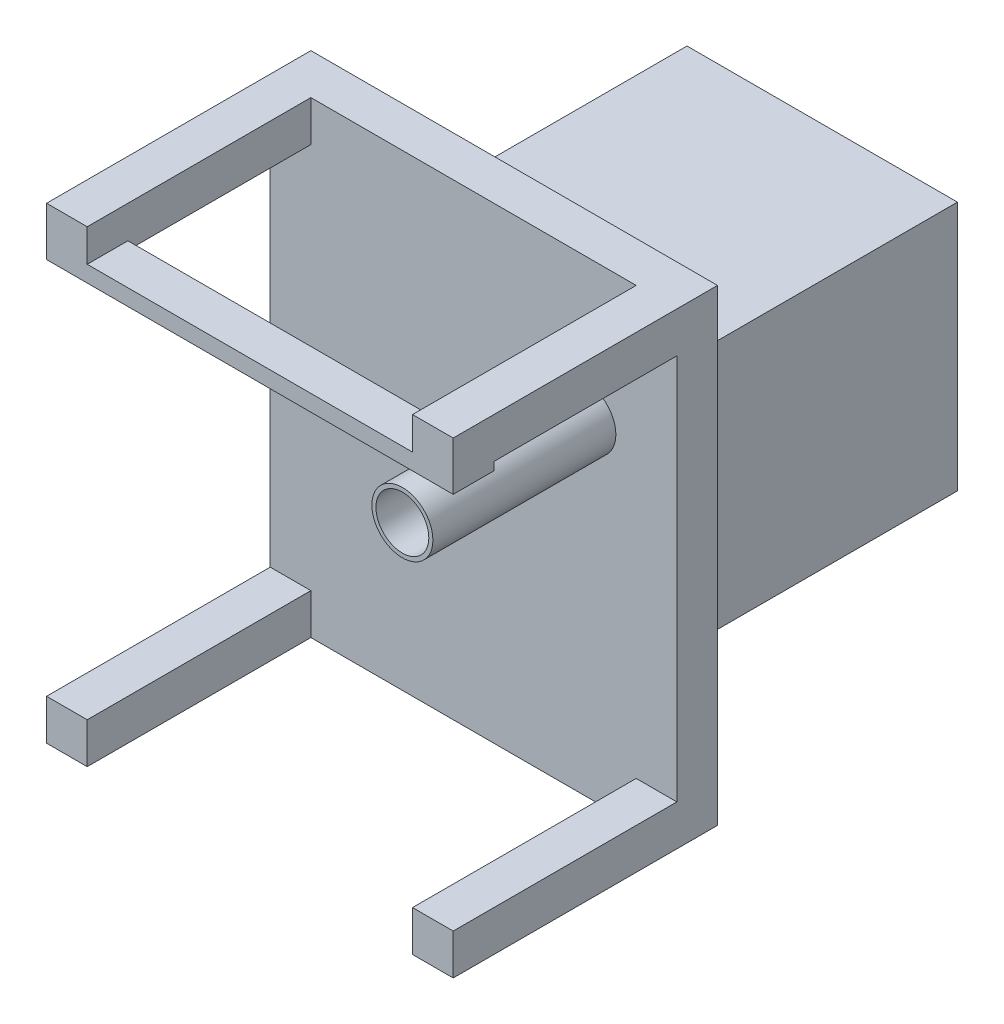
ISO-10303-21;
HEADER;
FILE_DESCRIPTION(('STEP AP214'),'2;1');
FILE_NAME('part.step','',(''),(''),'','','');
FILE_SCHEMA(('AUTOMOTIVE_DESIGN { 1 0 10303 214 1 1 1 1 }'));
ENDSEC;
DATA;
#1=APPLICATION_CONTEXT('core data for automotive mechanical design processes');
#2=APPLICATION_PROTOCOL_DEFINITION('international standard','automotive_design',2000,#1);
#3=PRODUCT_CONTEXT('',#1,'mechanical');
#4=PRODUCT('Part','Part','',(#3));
#5=PRODUCT_RELATED_PRODUCT_CATEGORY('part','',(#4));
#6=PRODUCT_DEFINITION_FORMATION('','',#4);
#7=PRODUCT_DEFINITION_CONTEXT('part definition',#1,'design');
#8=PRODUCT_DEFINITION('design','',#6,#7);
#9=PRODUCT_DEFINITION_SHAPE('','',#8);
#10=(LENGTH_UNIT() NAMED_UNIT(*) SI_UNIT(.MILLI.,.METRE.));
#11=(NAMED_UNIT(*) PLANE_ANGLE_UNIT() SI_UNIT($,.RADIAN.));
#12=(NAMED_UNIT(*) SI_UNIT($,.STERADIAN.) SOLID_ANGLE_UNIT());
#13=UNCERTAINTY_MEASURE_WITH_UNIT(LENGTH_MEASURE(1.E-05),#10,'distance_accuracy_value','');
#14=(GEOMETRIC_REPRESENTATION_CONTEXT(3) GLOBAL_UNCERTAINTY_ASSIGNED_CONTEXT((#13)) GLOBAL_UNIT_ASSIGNED_CONTEXT((#10,
#11,#12)) REPRESENTATION_CONTEXT('',''));
#15=CARTESIAN_POINT('',(0.,0.,0.));
#16=DIRECTION('',(0.,0.,1.));
#17=DIRECTION('',(1.,0.,0.));
#18=AXIS2_PLACEMENT_3D('',#15,#16,#17);
#19=CARTESIAN_POINT('',(0.,0.,0.));
#20=DIRECTION('',(0.,0.,1.));
#21=DIRECTION('',(1.,0.,0.));
#22=AXIS2_PLACEMENT_3D('',#19,#20,#21);
#23=PLANE('',#22);
#24=DIRECTION('',(1.,0.,0.));
#25=VECTOR('',#24,1.);
#26=CARTESIAN_POINT('',(-0.002000000000002,74.7384532343858,0.));
#27=LINE('',#26,#25);
#28=CARTESIAN_POINT('',(71.5,74.7384532343858,0.));
#29=VERTEX_POINT('',#28);
#30=CARTESIAN_POINT('',(75.0000000000001,74.7384532343858,0.));
#31=VERTEX_POINT('',#30);
#32=EDGE_CURVE('E272',#29,#31,#27,.T.);
#33=ORIENTED_EDGE('',*,*,#32,.F.);
#34=DIRECTION('',(0.,1.,0.));
#35=VECTOR('',#34,1.);
#36=CARTESIAN_POINT('',(71.5,-0.002000000000002,0.));
#37=LINE('',#36,#35);
#38=CARTESIAN_POINT('',(71.5,78.2384532343858,0.));
#39=VERTEX_POINT('',#38);
#40=EDGE_CURVE('E257',#29,#39,#37,.T.);
#41=ORIENTED_EDGE('',*,*,#40,.T.);
#42=CARTESIAN_POINT('',(77.5,80.7384532343858,0.));
#43=DIRECTION('',(0.,0.,1.));
#44=DIRECTION('',(1.,0.,0.));
#45=AXIS2_PLACEMENT_3D('',#42,#43,#44);
#46=CIRCLE('',#45,6.5);
#47=EDGE_CURVE('E273',#39,#31,#46,.T.);
#48=ORIENTED_EDGE('',*,*,#47,.T.);
#49=EDGE_LOOP('',(#33,#41,#48));
#50=FACE_BOUND('',#49,.T.);
#51=ADVANCED_FACE('F43',(#50),#23,.F.);
#52=CARTESIAN_POINT('',(80.,74.7384532343858,0.));
#53=VERTEX_POINT('',#52);
#54=CARTESIAN_POINT('',(84.,74.7384532343858,0.));
#55=VERTEX_POINT('',#54);
#56=EDGE_CURVE('E60',#53,#55,#27,.T.);
#57=ORIENTED_EDGE('',*,*,#56,.F.);
#58=CARTESIAN_POINT('',(84.,80.7384532343858,0.));
#59=VERTEX_POINT('',#58);
#60=EDGE_CURVE('E361',#53,#59,#46,.T.);
#61=ORIENTED_EDGE('',*,*,#60,.T.);
#62=DIRECTION('',(0.,1.,0.));
#63=VECTOR('',#62,1.);
#64=CARTESIAN_POINT('',(84.,30.7384532343858,0.));
#65=LINE('',#64,#63);
#66=EDGE_CURVE('E332',#55,#59,#65,.T.);
#67=ORIENTED_EDGE('',*,*,#66,.F.);
#68=EDGE_LOOP('',(#57,#61,#67));
#69=FACE_BOUND('',#68,.T.);
#70=ADVANCED_FACE('F606',(#69),#23,.F.);
#71=CARTESIAN_POINT('',(84.,35.7384532343858,0.));
#72=DIRECTION('',(0.,-1.,0.));
#73=DIRECTION('',(0.,0.,-1.));
#74=AXIS2_PLACEMENT_3D('',#71,#72,#73);
#75=PLANE('',#74);
#76=DIRECTION('',(1.,0.,0.));
#77=VECTOR('',#76,1.);
#78=CARTESIAN_POINT('',(-0.002000000000002,35.7384532343858,-50.));
#79=LINE('',#78,#77);
#80=CARTESIAN_POINT('',(27.5,35.7384532343858,-50.));
#81=VERTEX_POINT('',#80);
#82=CARTESIAN_POINT('',(84.,35.7384532343858,-50.));
#83=VERTEX_POINT('',#82);
#84=EDGE_CURVE('E277',#81,#83,#79,.T.);
#85=ORIENTED_EDGE('',*,*,#84,.T.);
#86=DIRECTION('',(0.,0.,1.));
#87=VECTOR('',#86,1.);
#88=CARTESIAN_POINT('',(84.,35.7384532343858,-70.));
#89=LINE('',#88,#87);
#90=CARTESIAN_POINT('',(84.,35.7384532343858,-70.));
#91=VERTEX_POINT('',#90);
#92=EDGE_CURVE('E339',#91,#83,#89,.T.);
#93=ORIENTED_EDGE('',*,*,#92,.F.);
#94=DIRECTION('',(-1.,0.,0.));
#95=VECTOR('',#94,1.);
#96=CARTESIAN_POINT('',(84.,35.7384532343858,-70.));
#97=LINE('',#96,#95);
#98=CARTESIAN_POINT('',(27.5,35.7384532343858,-70.));
#99=VERTEX_POINT('',#98);
#100=EDGE_CURVE('E297',#91,#99,#97,.T.);
#101=ORIENTED_EDGE('',*,*,#100,.T.);
#102=DIRECTION('',(0.,0.,-1.));
#103=VECTOR('',#102,1.);
#104=CARTESIAN_POINT('',(27.5,35.7384532343858,0.));
#105=LINE('',#104,#103);
#106=EDGE_CURVE('E300',#81,#99,#105,.T.);
#107=ORIENTED_EDGE('',*,*,#106,.F.);
#108=EDGE_LOOP('',(#85,#93,#101,#107));
#109=FACE_BOUND('',#108,.T.);
#110=ADVANCED_FACE('F611',(#109),#75,.F.);
#111=CARTESIAN_POINT('',(84.,30.7384532343858,-70.));
#112=DIRECTION('',(1.,0.,0.));
#113=DIRECTION('',(0.,0.,-1.));
#114=AXIS2_PLACEMENT_3D('',#111,#112,#113);
#115=PLANE('',#114);
#116=DIRECTION('',(0.,-0.615031798693877,-0.788502306017791));
#117=VECTOR('',#116,1.);
#118=CARTESIAN_POINT('',(84.,35.7384532343858,-50.));
#119=LINE('',#118,#117);
#120=EDGE_CURVE('E288',#55,#83,#119,.T.);
#121=ORIENTED_EDGE('',*,*,#120,.F.);
#122=ORIENTED_EDGE('',*,*,#66,.T.);
#123=CARTESIAN_POINT('',(84.,87.2384532343858,0.));
#124=VERTEX_POINT('',#123);
#125=EDGE_CURVE('E321',#59,#124,#65,.T.);
#126=ORIENTED_EDGE('',*,*,#125,.T.);
#127=DIRECTION('',(0.,0.,1.));
#128=VECTOR('',#127,1.);
#129=CARTESIAN_POINT('',(84.,87.2384532343858,-70.));
#130=LINE('',#129,#128);
#131=CARTESIAN_POINT('',(84.,87.2384532343858,-70.));
#132=VERTEX_POINT('',#131);
#133=EDGE_CURVE('E337',#132,#124,#130,.T.);
#134=ORIENTED_EDGE('',*,*,#133,.F.);
#135=DIRECTION('',(0.,1.,0.));
#136=VECTOR('',#135,1.);
#137=CARTESIAN_POINT('',(84.,30.7384532343858,-70.));
#138=LINE('',#137,#136);
#139=EDGE_CURVE('E322',#91,#132,#138,.T.);
#140=ORIENTED_EDGE('',*,*,#139,.F.);
#141=ORIENTED_EDGE('',*,*,#92,.T.);
#142=EDGE_LOOP('',(#121,#122,#126,#134,#140,#141));
#143=FACE_BOUND('',#142,.T.);
#144=ADVANCED_FACE('F645',(#143),#115,.F.);
#145=CARTESIAN_POINT('',(27.5,-0.002000000000002,-50.));
#146=DIRECTION('',(-0.750713516922755,0.,0.660627894892025));
#147=DIRECTION('',(0.660627894892025,0.,0.750713516922755));
#148=AXIS2_PLACEMENT_3D('',#145,#146,#147);
#149=PLANE('',#148);
#150=DIRECTION('',(-0.570084031750296,-0.505301755415035,-0.647822763352609));
#151=VECTOR('',#150,1.);
#152=CARTESIAN_POINT('',(18.561965418835,27.8161044010804,-60.1568574785966));
#153=LINE('',#152,#151);
#154=EDGE_CURVE('E262',#29,#81,#153,.T.);
#155=ORIENTED_EDGE('',*,*,#154,.T.);
#156=DIRECTION('',(0.,1.,0.));
#157=VECTOR('',#156,1.);
#158=CARTESIAN_POINT('',(27.5,-0.002000000000002,-50.));
#159=LINE('',#158,#157);
#160=CARTESIAN_POINT('',(27.5,87.2384532343858,-50.));
#161=VERTEX_POINT('',#160);
#162=EDGE_CURVE('E268',#81,#161,#159,.T.);
#163=ORIENTED_EDGE('',*,*,#162,.T.);
#164=DIRECTION('',(0.660627894892025,0.,0.750713516922755));
#165=VECTOR('',#164,1.);
#166=CARTESIAN_POINT('',(27.5,87.2384532343858,-50.));
#167=LINE('',#166,#165);
#168=CARTESIAN_POINT('',(71.5,87.2384532343858,0.));
#169=VERTEX_POINT('',#168);
#170=EDGE_CURVE('E287',#161,#169,#167,.T.);
#171=ORIENTED_EDGE('',*,*,#170,.T.);
#172=CARTESIAN_POINT('',(71.5,83.2384532343858,0.));
#173=VERTEX_POINT('',#172);
#174=EDGE_CURVE('E270',#173,#169,#37,.T.);
#175=ORIENTED_EDGE('',*,*,#174,.F.);
#176=EDGE_CURVE('E266',#39,#173,#37,.T.);
#177=ORIENTED_EDGE('',*,*,#176,.F.);
#178=ORIENTED_EDGE('',*,*,#40,.F.);
#179=EDGE_LOOP('',(#155,#163,#171,#175,#177,#178));
#180=FACE_BOUND('',#179,.T.);
#181=ADVANCED_FACE('F259',(#180),#149,.F.);
#182=ORIENTED_EDGE('',*,*,#174,.T.);
#183=DIRECTION('',(-1.,0.,0.));
#184=VECTOR('',#183,1.);
#185=CARTESIAN_POINT('',(22.5,87.2384532343858,0.));
#186=LINE('',#185,#184);
#187=CARTESIAN_POINT('',(77.5,87.2384532343858,0.));
#188=VERTEX_POINT('',#187);
#189=EDGE_CURVE('E313',#188,#169,#186,.T.);
#190=ORIENTED_EDGE('',*,*,#189,.F.);
#191=EDGE_CURVE('E366',#188,#173,#46,.T.);
#192=ORIENTED_EDGE('',*,*,#191,.T.);
#193=EDGE_LOOP('',(#182,#190,#192));
#194=FACE_BOUND('',#193,.T.);
#195=ADVANCED_FACE('F612',(#194),#23,.F.);
#196=CARTESIAN_POINT('',(22.5,87.2384532343858,-70.));
#197=DIRECTION('',(0.,1.,0.));
#198=DIRECTION('',(0.,0.,1.));
#199=AXIS2_PLACEMENT_3D('',#196,#197,#198);
#200=PLANE('',#199);
#201=ORIENTED_EDGE('',*,*,#170,.F.);
#202=DIRECTION('',(0.,0.,1.));
#203=VECTOR('',#202,1.);
#204=CARTESIAN_POINT('',(27.5,87.2384532343858,-70.));
#205=LINE('',#204,#203);
#206=CARTESIAN_POINT('',(27.5,87.2384532343858,-70.));
#207=VERTEX_POINT('',#206);
#208=EDGE_CURVE('E355',#207,#161,#205,.T.);
#209=ORIENTED_EDGE('',*,*,#208,.F.);
#210=DIRECTION('',(-1.,0.,0.));
#211=VECTOR('',#210,1.);
#212=CARTESIAN_POINT('',(22.5,87.2384532343858,-70.));
#213=LINE('',#212,#211);
#214=EDGE_CURVE('E306',#132,#207,#213,.T.);
#215=ORIENTED_EDGE('',*,*,#214,.F.);
#216=ORIENTED_EDGE('',*,*,#133,.T.);
#217=EDGE_CURVE('E307',#124,#188,#186,.T.);
#218=ORIENTED_EDGE('',*,*,#217,.T.);
#219=ORIENTED_EDGE('',*,*,#189,.T.);
#220=EDGE_LOOP('',(#201,#209,#215,#216,#218,#219));
#221=FACE_BOUND('',#220,.T.);
#222=ADVANCED_FACE('F623',(#221),#200,.F.);
#223=CARTESIAN_POINT('',(27.5,35.7384532343858,0.));
#224=DIRECTION('',(-1.,0.,0.));
#225=DIRECTION('',(0.,0.,1.));
#226=AXIS2_PLACEMENT_3D('',#223,#224,#225);
#227=PLANE('',#226);
#228=ORIENTED_EDGE('',*,*,#162,.F.);
#229=ORIENTED_EDGE('',*,*,#106,.T.);
#230=DIRECTION('',(0.,1.,0.));
#231=VECTOR('',#230,1.);
#232=CARTESIAN_POINT('',(27.5,35.7384532343858,-70.));
#233=LINE('',#232,#231);
#234=EDGE_CURVE('E295',#99,#207,#233,.T.);
#235=ORIENTED_EDGE('',*,*,#234,.T.);
#236=ORIENTED_EDGE('',*,*,#208,.T.);
#237=EDGE_LOOP('',(#228,#229,#235,#236));
#238=FACE_BOUND('',#237,.T.);
#239=ADVANCED_FACE('F617',(#238),#227,.F.);
#240=DIRECTION('',(1.,0.,0.));
#241=VECTOR('',#240,1.);
#242=CARTESIAN_POINT('',(0.,115.,0.));
#243=LINE('',#242,#241);
#244=CARTESIAN_POINT('',(0.,115.,0.));
#245=VERTEX_POINT('',#244);
#246=CARTESIAN_POINT('',(100.,115.,0.));
#247=VERTEX_POINT('',#246);
#248=EDGE_CURVE('E493',#245,#247,#243,.T.);
#249=ORIENTED_EDGE('',*,*,#248,.T.);
#250=DIRECTION('',(0.,1.,0.));
#251=VECTOR('',#250,1.);
#252=CARTESIAN_POINT('',(100.,0.,0.));
#253=LINE('',#252,#251);
#254=CARTESIAN_POINT('',(100.,0.,0.));
#255=VERTEX_POINT('',#254);
#256=EDGE_CURVE('E508',#255,#247,#253,.T.);
#257=ORIENTED_EDGE('',*,*,#256,.F.);
#258=DIRECTION('',(1.,0.,0.));
#259=VECTOR('',#258,1.);
#260=CARTESIAN_POINT('',(0.,0.,0.));
#261=LINE('',#260,#259);
#262=CARTESIAN_POINT('',(0.,0.,0.));
#263=VERTEX_POINT('',#262);
#264=EDGE_CURVE('E511',#263,#255,#261,.T.);
#265=ORIENTED_EDGE('',*,*,#264,.F.);
#266=DIRECTION('',(0.,1.,0.));
#267=VECTOR('',#266,1.);
#268=CARTESIAN_POINT('',(0.,0.,0.));
#269=LINE('',#268,#267);
#270=EDGE_CURVE('E498',#263,#245,#269,.T.);
#271=ORIENTED_EDGE('',*,*,#270,.T.);
#272=EDGE_LOOP('',(#249,#257,#265,#271));
#273=FACE_BOUND('',#272,.T.);
#274=DIRECTION('',(1.,0.,0.));
#275=VECTOR('',#274,1.);
#276=CARTESIAN_POINT('',(22.5,92.2384532343858,0.));
#277=LINE('',#276,#275);
#278=CARTESIAN_POINT('',(22.5,92.2384532343858,0.));
#279=VERTEX_POINT('',#278);
#280=CARTESIAN_POINT('',(89.,92.2384532343858,0.));
#281=VERTEX_POINT('',#280);
#282=EDGE_CURVE('E302',#279,#281,#277,.T.);
#283=ORIENTED_EDGE('',*,*,#282,.F.);
#284=DIRECTION('',(0.,-1.,0.));
#285=VECTOR('',#284,1.);
#286=CARTESIAN_POINT('',(22.5,0.,0.));
#287=LINE('',#286,#285);
#288=CARTESIAN_POINT('',(22.5,30.7384532343858,0.));
#289=VERTEX_POINT('',#288);
#290=EDGE_CURVE('E342',#279,#289,#287,.T.);
#291=ORIENTED_EDGE('',*,*,#290,.T.);
#292=DIRECTION('',(-1.,0.,0.));
#293=VECTOR('',#292,1.);
#294=CARTESIAN_POINT('',(0.,30.7384532343858,0.));
#295=LINE('',#294,#293);
#296=CARTESIAN_POINT('',(89.,30.7384532343858,0.));
#297=VERTEX_POINT('',#296);
#298=EDGE_CURVE('E347',#297,#289,#295,.T.);
#299=ORIENTED_EDGE('',*,*,#298,.F.);
#300=DIRECTION('',(0.,-1.,0.));
#301=VECTOR('',#300,1.);
#302=CARTESIAN_POINT('',(89.,30.7384532343858,0.));
#303=LINE('',#302,#301);
#304=EDGE_CURVE('E326',#281,#297,#303,.T.);
#305=ORIENTED_EDGE('',*,*,#304,.F.);
#306=EDGE_LOOP('',(#283,#291,#299,#305));
#307=FACE_BOUND('',#306,.T.);
#308=ADVANCED_FACE('F527',(#273,#307),#23,.F.);
#309=ORIENTED_EDGE('',*,*,#217,.F.);
#310=ORIENTED_EDGE('',*,*,#125,.F.);
#311=EDGE_CURVE('E362',#59,#188,#46,.T.);
#312=ORIENTED_EDGE('',*,*,#311,.T.);
#313=EDGE_LOOP('',(#309,#310,#312));
#314=FACE_BOUND('',#313,.T.);
#315=ADVANCED_FACE('F616',(#314),#23,.F.);
#316=CARTESIAN_POINT('',(10.,115.,65.));
#317=DIRECTION('',(1.,0.,0.));
#318=DIRECTION('',(0.,1.,0.));
#319=AXIS2_PLACEMENT_3D('',#316,#317,#318);
#320=PLANE('',#319);
#321=DIRECTION('',(0.,0.,1.));
#322=VECTOR('',#321,1.);
#323=CARTESIAN_POINT('',(10.,107.,55.));
#324=LINE('',#323,#322);
#325=CARTESIAN_POINT('',(10.,107.,55.));
#326=VERTEX_POINT('',#325);
#327=CARTESIAN_POINT('',(10.,107.,65.));
#328=VERTEX_POINT('',#327);
#329=EDGE_CURVE('E370',#326,#328,#324,.T.);
#330=ORIENTED_EDGE('',*,*,#329,.F.);
#331=DIRECTION('',(0.,-1.,0.));
#332=VECTOR('',#331,1.);
#333=CARTESIAN_POINT('',(10.,107.,55.));
#334=LINE('',#333,#332);
#335=CARTESIAN_POINT('',(10.,105.,55.));
#336=VERTEX_POINT('',#335);
#337=EDGE_CURVE('E381',#326,#336,#334,.T.);
#338=ORIENTED_EDGE('',*,*,#337,.T.);
#339=DIRECTION('',(0.,0.,-1.));
#340=VECTOR('',#339,1.);
#341=CARTESIAN_POINT('',(10.,105.,65.));
#342=LINE('',#341,#340);
#343=CARTESIAN_POINT('',(10.,105.,9.99999999999999));
#344=VERTEX_POINT('',#343);
#345=EDGE_CURVE('E491',#336,#344,#342,.T.);
#346=ORIENTED_EDGE('',*,*,#345,.T.);
#347=DIRECTION('',(0.,-1.,0.));
#348=VECTOR('',#347,1.);
#349=CARTESIAN_POINT('',(10.,115.,9.99999999999999));
#350=LINE('',#349,#348);
#351=CARTESIAN_POINT('',(10.,115.,9.99999999999999));
#352=VERTEX_POINT('',#351);
#353=EDGE_CURVE('E478',#352,#344,#350,.T.);
#354=ORIENTED_EDGE('',*,*,#353,.F.);
#355=DIRECTION('',(0.,0.,-1.));
#356=VECTOR('',#355,1.);
#357=CARTESIAN_POINT('',(10.,115.,65.));
#358=LINE('',#357,#356);
#359=CARTESIAN_POINT('',(10.,115.,65.));
#360=VERTEX_POINT('',#359);
#361=EDGE_CURVE('E489',#360,#352,#358,.T.);
#362=ORIENTED_EDGE('',*,*,#361,.F.);
#363=DIRECTION('',(0.,-1.,0.));
#364=VECTOR('',#363,1.);
#365=CARTESIAN_POINT('',(10.,115.,65.));
#366=LINE('',#365,#364);
#367=EDGE_CURVE('E474',#360,#328,#366,.T.);
#368=ORIENTED_EDGE('',*,*,#367,.T.);
#369=EDGE_LOOP('',(#330,#338,#346,#354,#362,#368));
#370=FACE_BOUND('',#369,.T.);
#371=ADVANCED_FACE('F544',(#370),#320,.T.);
#372=CARTESIAN_POINT('',(90.,115.,65.));
#373=DIRECTION('',(1.,0.,0.));
#374=DIRECTION('',(0.,0.,-1.));
#375=AXIS2_PLACEMENT_3D('',#372,#373,#374);
#376=PLANE('',#375);
#377=DIRECTION('',(0.,-1.,0.));
#378=VECTOR('',#377,1.);
#379=CARTESIAN_POINT('',(90.,107.,55.));
#380=LINE('',#379,#378);
#381=CARTESIAN_POINT('',(90.,107.,55.));
#382=VERTEX_POINT('',#381);
#383=CARTESIAN_POINT('',(90.,105.,55.));
#384=VERTEX_POINT('',#383);
#385=EDGE_CURVE('E383',#382,#384,#380,.T.);
#386=ORIENTED_EDGE('',*,*,#385,.F.);
#387=DIRECTION('',(0.,0.,-1.));
#388=VECTOR('',#387,1.);
#389=CARTESIAN_POINT('',(90.,107.,55.));
#390=LINE('',#389,#388);
#391=CARTESIAN_POINT('',(90.,107.,65.));
#392=VERTEX_POINT('',#391);
#393=EDGE_CURVE('E377',#392,#382,#390,.T.);
#394=ORIENTED_EDGE('',*,*,#393,.F.);
#395=DIRECTION('',(0.,-1.,0.));
#396=VECTOR('',#395,1.);
#397=CARTESIAN_POINT('',(90.,115.,65.));
#398=LINE('',#397,#396);
#399=CARTESIAN_POINT('',(90.,115.,65.));
#400=VERTEX_POINT('',#399);
#401=EDGE_CURVE('E460',#400,#392,#398,.T.);
#402=ORIENTED_EDGE('',*,*,#401,.F.);
#403=DIRECTION('',(0.,0.,-1.));
#404=VECTOR('',#403,1.);
#405=CARTESIAN_POINT('',(90.,115.,65.));
#406=LINE('',#405,#404);
#407=CARTESIAN_POINT('',(90.,115.,9.99999999999999));
#408=VERTEX_POINT('',#407);
#409=EDGE_CURVE('E471',#400,#408,#406,.T.);
#410=ORIENTED_EDGE('',*,*,#409,.T.);
#411=DIRECTION('',(0.,-1.,0.));
#412=VECTOR('',#411,1.);
#413=CARTESIAN_POINT('',(90.,115.,9.99999999999999));
#414=LINE('',#413,#412);
#415=CARTESIAN_POINT('',(90.,105.,9.99999999999999));
#416=VERTEX_POINT('',#415);
#417=EDGE_CURVE('E453',#408,#416,#414,.T.);
#418=ORIENTED_EDGE('',*,*,#417,.T.);
#419=DIRECTION('',(0.,0.,-1.));
#420=VECTOR('',#419,1.);
#421=CARTESIAN_POINT('',(90.,105.,65.));
#422=LINE('',#421,#420);
#423=EDGE_CURVE('E469',#384,#416,#422,.T.);
#424=ORIENTED_EDGE('',*,*,#423,.F.);
#425=EDGE_LOOP('',(#386,#394,#402,#410,#418,#424));
#426=FACE_BOUND('',#425,.T.);
#427=ADVANCED_FACE('F556',(#426),#376,.F.);
#428=CARTESIAN_POINT('',(0.,105.,65.));
#429=DIRECTION('',(0.,1.,0.));
#430=DIRECTION('',(0.,0.,1.));
#431=AXIS2_PLACEMENT_3D('',#428,#429,#430);
#432=PLANE('',#431);
#433=DIRECTION('',(1.,0.,0.));
#434=VECTOR('',#433,1.);
#435=CARTESIAN_POINT('',(100.,105.,55.));
#436=LINE('',#435,#434);
#437=CARTESIAN_POINT('',(0.,105.,55.));
#438=VERTEX_POINT('',#437);
#439=EDGE_CURVE('E390',#438,#336,#436,.T.);
#440=ORIENTED_EDGE('',*,*,#439,.F.);
#441=DIRECTION('',(0.,0.,-1.));
#442=VECTOR('',#441,1.);
#443=CARTESIAN_POINT('',(0.,105.,65.));
#444=LINE('',#443,#442);
#445=CARTESIAN_POINT('',(0.,105.,9.99999999999999));
#446=VERTEX_POINT('',#445);
#447=EDGE_CURVE('E483',#438,#446,#444,.T.);
#448=ORIENTED_EDGE('',*,*,#447,.T.);
#449=DIRECTION('',(1.,0.,0.));
#450=VECTOR('',#449,1.);
#451=CARTESIAN_POINT('',(0.,105.,9.99999999999999));
#452=LINE('',#451,#450);
#453=EDGE_CURVE('E473',#446,#344,#452,.T.);
#454=ORIENTED_EDGE('',*,*,#453,.T.);
#455=ORIENTED_EDGE('',*,*,#345,.F.);
#456=EDGE_LOOP('',(#440,#448,#454,#455));
#457=FACE_BOUND('',#456,.T.);
#458=ADVANCED_FACE('F944',(#457),#432,.F.);
#459=CARTESIAN_POINT('',(100.,105.,65.));
#460=DIRECTION('',(0.,1.,0.));
#461=DIRECTION('',(0.,0.,1.));
#462=AXIS2_PLACEMENT_3D('',#459,#460,#461);
#463=PLANE('',#462);
#464=CARTESIAN_POINT('',(100.,105.,55.));
#465=VERTEX_POINT('',#464);
#466=EDGE_CURVE('E385',#384,#465,#436,.T.);
#467=ORIENTED_EDGE('',*,*,#466,.F.);
#468=ORIENTED_EDGE('',*,*,#423,.T.);
#469=DIRECTION('',(1.,0.,0.));
#470=VECTOR('',#469,1.);
#471=CARTESIAN_POINT('',(100.,105.,9.99999999999999));
#472=LINE('',#471,#470);
#473=CARTESIAN_POINT('',(100.,105.,9.99999999999999));
#474=VERTEX_POINT('',#473);
#475=EDGE_CURVE('E458',#416,#474,#472,.T.);
#476=ORIENTED_EDGE('',*,*,#475,.T.);
#477=DIRECTION('',(0.,0.,-1.));
#478=VECTOR('',#477,1.);
#479=CARTESIAN_POINT('',(100.,105.,65.));
#480=LINE('',#479,#478);
#481=EDGE_CURVE('E463',#465,#474,#480,.T.);
#482=ORIENTED_EDGE('',*,*,#481,.F.);
#483=EDGE_LOOP('',(#467,#468,#476,#482));
#484=FACE_BOUND('',#483,.T.);
#485=ADVANCED_FACE('F570',(#484),#463,.F.);
#486=CARTESIAN_POINT('',(0.,0.,9.99999999999999));
#487=DIRECTION('',(0.,0.,1.));
#488=DIRECTION('',(1.,0.,0.));
#489=AXIS2_PLACEMENT_3D('',#486,#487,#488);
#490=PLANE('',#489);
#491=CARTESIAN_POINT('',(77.5,80.7384532343858,9.99999999999999));
#492=DIRECTION('',(0.,0.,1.));
#493=DIRECTION('',(1.,0.,0.));
#494=AXIS2_PLACEMENT_3D('',#491,#492,#493);
#495=CIRCLE('',#494,7.5);
#496=CARTESIAN_POINT('',(85.,80.7384532343858,9.99999999999999));
#497=VERTEX_POINT('',#496);
#498=EDGE_CURVE('E365',#497,#497,#495,.T.);
#499=ORIENTED_EDGE('',*,*,#498,.F.);
#500=EDGE_LOOP('',(#499));
#501=FACE_BOUND('',#500,.T.);
#502=DIRECTION('',(0.,-1.,0.));
#503=VECTOR('',#502,1.);
#504=CARTESIAN_POINT('',(90.,0.,9.99999999999999));
#505=LINE('',#504,#503);
#506=CARTESIAN_POINT('',(90.,10.,9.99999999999999));
#507=VERTEX_POINT('',#506);
#508=CARTESIAN_POINT('',(90.,0.,9.99999999999999));
#509=VERTEX_POINT('',#508);
#510=EDGE_CURVE('E409',#507,#509,#505,.T.);
#511=ORIENTED_EDGE('',*,*,#510,.F.);
#512=DIRECTION('',(-1.,0.,0.));
#513=VECTOR('',#512,1.);
#514=CARTESIAN_POINT('',(100.,10.,9.99999999999999));
#515=LINE('',#514,#513);
#516=CARTESIAN_POINT('',(100.,10.,9.99999999999999));
#517=VERTEX_POINT('',#516);
#518=EDGE_CURVE('E404',#517,#507,#515,.T.);
#519=ORIENTED_EDGE('',*,*,#518,.F.);
#520=DIRECTION('',(0.,1.,0.));
#521=VECTOR('',#520,1.);
#522=CARTESIAN_POINT('',(100.,0.,9.99999999999999));
#523=LINE('',#522,#521);
#524=EDGE_CURVE('E497',#517,#474,#523,.T.);
#525=ORIENTED_EDGE('',*,*,#524,.T.);
#526=ORIENTED_EDGE('',*,*,#475,.F.);
#527=ORIENTED_EDGE('',*,*,#417,.F.);
#528=DIRECTION('',(1.,0.,0.));
#529=VECTOR('',#528,1.);
#530=CARTESIAN_POINT('',(0.,115.,9.99999999999999));
#531=LINE('',#530,#529);
#532=EDGE_CURVE('E494',#352,#408,#531,.T.);
#533=ORIENTED_EDGE('',*,*,#532,.F.);
#534=ORIENTED_EDGE('',*,*,#353,.T.);
#535=ORIENTED_EDGE('',*,*,#453,.F.);
#536=DIRECTION('',(0.,1.,0.));
#537=VECTOR('',#536,1.);
#538=CARTESIAN_POINT('',(0.,0.,9.99999999999999));
#539=LINE('',#538,#537);
#540=CARTESIAN_POINT('',(0.,10.,9.99999999999999));
#541=VERTEX_POINT('',#540);
#542=EDGE_CURVE('E503',#541,#446,#539,.T.);
#543=ORIENTED_EDGE('',*,*,#542,.F.);
#544=DIRECTION('',(-1.,0.,0.));
#545=VECTOR('',#544,1.);
#546=CARTESIAN_POINT('',(0.,10.,9.99999999999999));
#547=LINE('',#546,#545);
#548=CARTESIAN_POINT('',(10.,10.,9.99999999999999));
#549=VERTEX_POINT('',#548);
#550=EDGE_CURVE('E434',#549,#541,#547,.T.);
#551=ORIENTED_EDGE('',*,*,#550,.F.);
#552=DIRECTION('',(0.,1.,0.));
#553=VECTOR('',#552,1.);
#554=CARTESIAN_POINT('',(10.,0.,9.99999999999999));
#555=LINE('',#554,#553);
#556=CARTESIAN_POINT('',(10.,0.,9.99999999999999));
#557=VERTEX_POINT('',#556);
#558=EDGE_CURVE('E429',#557,#549,#555,.T.);
#559=ORIENTED_EDGE('',*,*,#558,.F.);
#560=DIRECTION('',(1.,0.,0.));
#561=VECTOR('',#560,1.);
#562=CARTESIAN_POINT('',(0.,0.,9.99999999999999));
#563=LINE('',#562,#561);
#564=EDGE_CURVE('E501',#557,#509,#563,.T.);
#565=ORIENTED_EDGE('',*,*,#564,.T.);
#566=EDGE_LOOP('',(#511,#519,#525,#526,#527,#533,#534,#535,#543,#551,#559,#565));
#567=FACE_BOUND('',#566,.T.);
#568=ADVANCED_FACE('F550',(#501,#567),#490,.T.);
#569=CARTESIAN_POINT('',(0.,115.,9.99999999999999));
#570=DIRECTION('',(0.,1.,0.));
#571=DIRECTION('',(0.,0.,1.));
#572=AXIS2_PLACEMENT_3D('',#569,#570,#571);
#573=PLANE('',#572);
#574=ORIENTED_EDGE('',*,*,#248,.F.);
#575=DIRECTION('',(0.,0.,-1.));
#576=VECTOR('',#575,1.);
#577=CARTESIAN_POINT('',(0.,115.,9.99999999999999));
#578=LINE('',#577,#576);
#579=CARTESIAN_POINT('',(0.,115.,65.));
#580=VERTEX_POINT('',#579);
#581=EDGE_CURVE('E11',#580,#245,#578,.T.);
#582=ORIENTED_EDGE('',*,*,#581,.F.);
#583=DIRECTION('',(1.,0.,0.));
#584=VECTOR('',#583,1.);
#585=CARTESIAN_POINT('',(0.,115.,65.));
#586=LINE('',#585,#584);
#587=EDGE_CURVE('E477',#580,#360,#586,.T.);
#588=ORIENTED_EDGE('',*,*,#587,.T.);
#589=ORIENTED_EDGE('',*,*,#361,.T.);
#590=ORIENTED_EDGE('',*,*,#532,.T.);
#591=ORIENTED_EDGE('',*,*,#409,.F.);
#592=DIRECTION('',(-1.,0.,0.));
#593=VECTOR('',#592,1.);
#594=CARTESIAN_POINT('',(100.,115.,65.));
#595=LINE('',#594,#593);
#596=CARTESIAN_POINT('',(100.,115.,65.));
#597=VERTEX_POINT('',#596);
#598=EDGE_CURVE('E457',#597,#400,#595,.T.);
#599=ORIENTED_EDGE('',*,*,#598,.F.);
#600=DIRECTION('',(0.,0.,-1.));
#601=VECTOR('',#600,1.);
#602=CARTESIAN_POINT('',(100.,115.,9.99999999999999));
#603=LINE('',#602,#601);
#604=EDGE_CURVE('E47',#597,#247,#603,.T.);
#605=ORIENTED_EDGE('',*,*,#604,.T.);
#606=EDGE_LOOP('',(#574,#582,#588,#589,#590,#591,#599,#605));
#607=FACE_BOUND('',#606,.T.);
#608=ADVANCED_FACE('F45',(#607),#573,.T.);
#609=CARTESIAN_POINT('',(0.,0.,9.99999999999999));
#610=DIRECTION('',(-1.,0.,0.));
#611=DIRECTION('',(0.,0.,1.));
#612=AXIS2_PLACEMENT_3D('',#609,#610,#611);
#613=PLANE('',#612);
#614=ORIENTED_EDGE('',*,*,#270,.F.);
#615=DIRECTION('',(0.,0.,-1.));
#616=VECTOR('',#615,1.);
#617=CARTESIAN_POINT('',(0.,0.,9.99999999999999));
#618=LINE('',#617,#616);
#619=CARTESIAN_POINT('',(0.,0.,65.));
#620=VERTEX_POINT('',#619);
#621=EDGE_CURVE('E52',#620,#263,#618,.T.);
#622=ORIENTED_EDGE('',*,*,#621,.F.);
#623=DIRECTION('',(0.,-1.,0.));
#624=VECTOR('',#623,1.);
#625=CARTESIAN_POINT('',(0.,0.,65.));
#626=LINE('',#625,#624);
#627=CARTESIAN_POINT('',(0.,10.,65.));
#628=VERTEX_POINT('',#627);
#629=EDGE_CURVE('E430',#628,#620,#626,.T.);
#630=ORIENTED_EDGE('',*,*,#629,.F.);
#631=DIRECTION('',(0.,0.,-1.));
#632=VECTOR('',#631,1.);
#633=CARTESIAN_POINT('',(0.,10.,65.));
#634=LINE('',#633,#632);
#635=EDGE_CURVE('E440',#628,#541,#634,.T.);
#636=ORIENTED_EDGE('',*,*,#635,.T.);
#637=ORIENTED_EDGE('',*,*,#542,.T.);
#638=ORIENTED_EDGE('',*,*,#447,.F.);
#639=DIRECTION('',(0.,1.,0.));
#640=VECTOR('',#639,1.);
#641=CARTESIAN_POINT('',(0.,103.,55.));
#642=LINE('',#641,#640);
#643=CARTESIAN_POINT('',(0.,103.,55.));
#644=VERTEX_POINT('',#643);
#645=EDGE_CURVE('E402',#644,#438,#642,.T.);
#646=ORIENTED_EDGE('',*,*,#645,.F.);
#647=DIRECTION('',(0.,0.,-1.));
#648=VECTOR('',#647,1.);
#649=CARTESIAN_POINT('',(0.,103.,65.));
#650=LINE('',#649,#648);
#651=CARTESIAN_POINT('',(0.,103.,65.));
#652=VERTEX_POINT('',#651);
#653=EDGE_CURVE('E393',#652,#644,#650,.T.);
#654=ORIENTED_EDGE('',*,*,#653,.F.);
#655=DIRECTION('',(0.,-1.,0.));
#656=VECTOR('',#655,1.);
#657=CARTESIAN_POINT('',(0.,115.,65.));
#658=LINE('',#657,#656);
#659=EDGE_CURVE('E481',#580,#652,#658,.T.);
#660=ORIENTED_EDGE('',*,*,#659,.F.);
#661=ORIENTED_EDGE('',*,*,#581,.T.);
#662=EDGE_LOOP('',(#614,#622,#630,#636,#637,#638,#646,#654,#660,#661));
#663=FACE_BOUND('',#662,.T.);
#664=ADVANCED_FACE('F531',(#663),#613,.T.);
#665=CARTESIAN_POINT('',(0.,0.,9.99999999999999));
#666=DIRECTION('',(0.,1.,0.));
#667=DIRECTION('',(0.,0.,1.));
#668=AXIS2_PLACEMENT_3D('',#665,#666,#667);
#669=PLANE('',#668);
#670=ORIENTED_EDGE('',*,*,#264,.T.);
#671=DIRECTION('',(0.,0.,-1.));
#672=VECTOR('',#671,1.);
#673=CARTESIAN_POINT('',(100.,0.,9.99999999999999));
#674=LINE('',#673,#672);
#675=CARTESIAN_POINT('',(100.,0.,65.));
#676=VERTEX_POINT('',#675);
#677=EDGE_CURVE('E515',#676,#255,#674,.T.);
#678=ORIENTED_EDGE('',*,*,#677,.F.);
#679=DIRECTION('',(1.,0.,0.));
#680=VECTOR('',#679,1.);
#681=CARTESIAN_POINT('',(100.,0.,65.));
#682=LINE('',#681,#680);
#683=CARTESIAN_POINT('',(90.,0.,65.));
#684=VERTEX_POINT('',#683);
#685=EDGE_CURVE('E413',#684,#676,#682,.T.);
#686=ORIENTED_EDGE('',*,*,#685,.F.);
#687=DIRECTION('',(0.,0.,-1.));
#688=VECTOR('',#687,1.);
#689=CARTESIAN_POINT('',(90.,0.,65.));
#690=LINE('',#689,#688);
#691=EDGE_CURVE('E416',#684,#509,#690,.T.);
#692=ORIENTED_EDGE('',*,*,#691,.T.);
#693=ORIENTED_EDGE('',*,*,#564,.F.);
#694=DIRECTION('',(0.,0.,-1.));
#695=VECTOR('',#694,1.);
#696=CARTESIAN_POINT('',(10.,0.,65.));
#697=LINE('',#696,#695);
#698=CARTESIAN_POINT('',(10.,0.,65.));
#699=VERTEX_POINT('',#698);
#700=EDGE_CURVE('E450',#699,#557,#697,.T.);
#701=ORIENTED_EDGE('',*,*,#700,.F.);
#702=DIRECTION('',(1.,0.,0.));
#703=VECTOR('',#702,1.);
#704=CARTESIAN_POINT('',(0.,0.,65.));
#705=LINE('',#704,#703);
#706=EDGE_CURVE('E433',#620,#699,#705,.T.);
#707=ORIENTED_EDGE('',*,*,#706,.F.);
#708=ORIENTED_EDGE('',*,*,#621,.T.);
#709=EDGE_LOOP('',(#670,#678,#686,#692,#693,#701,#707,#708));
#710=FACE_BOUND('',#709,.T.);
#711=ADVANCED_FACE('F582',(#710),#669,.F.);
#712=CARTESIAN_POINT('',(100.,0.,9.99999999999999));
#713=DIRECTION('',(-1.,0.,0.));
#714=DIRECTION('',(0.,0.,1.));
#715=AXIS2_PLACEMENT_3D('',#712,#713,#714);
#716=PLANE('',#715);
#717=ORIENTED_EDGE('',*,*,#256,.T.);
#718=ORIENTED_EDGE('',*,*,#604,.F.);
#719=DIRECTION('',(0.,1.,0.));
#720=VECTOR('',#719,1.);
#721=CARTESIAN_POINT('',(100.,115.,65.));
#722=LINE('',#721,#720);
#723=CARTESIAN_POINT('',(100.,103.,65.));
#724=VERTEX_POINT('',#723);
#725=EDGE_CURVE('E454',#724,#597,#722,.T.);
#726=ORIENTED_EDGE('',*,*,#725,.F.);
#727=DIRECTION('',(0.,0.,1.));
#728=VECTOR('',#727,1.);
#729=CARTESIAN_POINT('',(100.,103.,65.));
#730=LINE('',#729,#728);
#731=CARTESIAN_POINT('',(100.,103.,55.));
#732=VERTEX_POINT('',#731);
#733=EDGE_CURVE('E386',#732,#724,#730,.T.);
#734=ORIENTED_EDGE('',*,*,#733,.F.);
#735=DIRECTION('',(0.,1.,0.));
#736=VECTOR('',#735,1.);
#737=CARTESIAN_POINT('',(100.,103.,55.));
#738=LINE('',#737,#736);
#739=EDGE_CURVE('E397',#732,#465,#738,.T.);
#740=ORIENTED_EDGE('',*,*,#739,.T.);
#741=ORIENTED_EDGE('',*,*,#481,.T.);
#742=ORIENTED_EDGE('',*,*,#524,.F.);
#743=DIRECTION('',(0.,0.,-1.));
#744=VECTOR('',#743,1.);
#745=CARTESIAN_POINT('',(100.,10.,65.));
#746=LINE('',#745,#744);
#747=CARTESIAN_POINT('',(100.,10.,65.));
#748=VERTEX_POINT('',#747);
#749=EDGE_CURVE('E426',#748,#517,#746,.T.);
#750=ORIENTED_EDGE('',*,*,#749,.F.);
#751=DIRECTION('',(0.,1.,0.));
#752=VECTOR('',#751,1.);
#753=CARTESIAN_POINT('',(100.,0.,65.));
#754=LINE('',#753,#752);
#755=EDGE_CURVE('E405',#676,#748,#754,.T.);
#756=ORIENTED_EDGE('',*,*,#755,.F.);
#757=ORIENTED_EDGE('',*,*,#677,.T.);
#758=EDGE_LOOP('',(#717,#718,#726,#734,#740,#741,#742,#750,#756,#757));
#759=FACE_BOUND('',#758,.T.);
#760=ADVANCED_FACE('F524',(#759),#716,.F.);
#761=CARTESIAN_POINT('',(0.,0.,65.));
#762=DIRECTION('',(0.,0.,-1.));
#763=DIRECTION('',(-1.,0.,0.));
#764=AXIS2_PLACEMENT_3D('',#761,#762,#763);
#765=PLANE('',#764);
#766=ORIENTED_EDGE('',*,*,#659,.T.);
#767=DIRECTION('',(-1.,0.,0.));
#768=VECTOR('',#767,1.);
#769=CARTESIAN_POINT('',(100.,103.,65.));
#770=LINE('',#769,#768);
#771=EDGE_CURVE('E389',#724,#652,#770,.T.);
#772=ORIENTED_EDGE('',*,*,#771,.F.);
#773=ORIENTED_EDGE('',*,*,#725,.T.);
#774=ORIENTED_EDGE('',*,*,#598,.T.);
#775=ORIENTED_EDGE('',*,*,#401,.T.);
#776=DIRECTION('',(1.,0.,0.));
#777=VECTOR('',#776,1.);
#778=CARTESIAN_POINT('',(10.,107.,65.));
#779=LINE('',#778,#777);
#780=EDGE_CURVE('E375',#328,#392,#779,.T.);
#781=ORIENTED_EDGE('',*,*,#780,.F.);
#782=ORIENTED_EDGE('',*,*,#367,.F.);
#783=ORIENTED_EDGE('',*,*,#587,.F.);
#784=EDGE_LOOP('',(#766,#772,#773,#774,#775,#781,#782,#783));
#785=FACE_BOUND('',#784,.T.);
#786=ADVANCED_FACE('F540',(#785),#765,.F.);
#787=CARTESIAN_POINT('',(10.,0.,65.));
#788=DIRECTION('',(-1.,0.,0.));
#789=DIRECTION('',(0.,0.,1.));
#790=AXIS2_PLACEMENT_3D('',#787,#788,#789);
#791=PLANE('',#790);
#792=ORIENTED_EDGE('',*,*,#558,.T.);
#793=DIRECTION('',(0.,0.,-1.));
#794=VECTOR('',#793,1.);
#795=CARTESIAN_POINT('',(10.,10.,65.));
#796=LINE('',#795,#794);
#797=CARTESIAN_POINT('',(10.,10.,65.));
#798=VERTEX_POINT('',#797);
#799=EDGE_CURVE('E447',#798,#549,#796,.T.);
#800=ORIENTED_EDGE('',*,*,#799,.F.);
#801=DIRECTION('',(0.,1.,0.));
#802=VECTOR('',#801,1.);
#803=CARTESIAN_POINT('',(10.,0.,65.));
#804=LINE('',#803,#802);
#805=EDGE_CURVE('E436',#699,#798,#804,.T.);
#806=ORIENTED_EDGE('',*,*,#805,.F.);
#807=ORIENTED_EDGE('',*,*,#700,.T.);
#808=EDGE_LOOP('',(#792,#800,#806,#807));
#809=FACE_BOUND('',#808,.T.);
#810=ADVANCED_FACE('F595',(#809),#791,.F.);
#811=CARTESIAN_POINT('',(0.,10.,65.));
#812=DIRECTION('',(0.,-1.,0.));
#813=DIRECTION('',(0.,0.,-1.));
#814=AXIS2_PLACEMENT_3D('',#811,#812,#813);
#815=PLANE('',#814);
#816=ORIENTED_EDGE('',*,*,#550,.T.);
#817=ORIENTED_EDGE('',*,*,#635,.F.);
#818=DIRECTION('',(-1.,0.,0.));
#819=VECTOR('',#818,1.);
#820=CARTESIAN_POINT('',(0.,10.,65.));
#821=LINE('',#820,#819);
#822=EDGE_CURVE('E438',#798,#628,#821,.T.);
#823=ORIENTED_EDGE('',*,*,#822,.F.);
#824=ORIENTED_EDGE('',*,*,#799,.T.);
#825=EDGE_LOOP('',(#816,#817,#823,#824));
#826=FACE_BOUND('',#825,.T.);
#827=ADVANCED_FACE('F591',(#826),#815,.F.);
#828=CARTESIAN_POINT('',(0.,0.,65.));
#829=DIRECTION('',(0.,0.,-1.));
#830=DIRECTION('',(-1.,0.,0.));
#831=AXIS2_PLACEMENT_3D('',#828,#829,#830);
#832=PLANE('',#831);
#833=ORIENTED_EDGE('',*,*,#629,.T.);
#834=ORIENTED_EDGE('',*,*,#706,.T.);
#835=ORIENTED_EDGE('',*,*,#805,.T.);
#836=ORIENTED_EDGE('',*,*,#822,.T.);
#837=EDGE_LOOP('',(#833,#834,#835,#836));
#838=FACE_BOUND('',#837,.T.);
#839=ADVANCED_FACE('F586',(#838),#832,.F.);
#840=CARTESIAN_POINT('',(100.,10.,65.));
#841=DIRECTION('',(0.,-1.,0.));
#842=DIRECTION('',(1.,0.,0.));
#843=AXIS2_PLACEMENT_3D('',#840,#841,#842);
#844=PLANE('',#843);
#845=ORIENTED_EDGE('',*,*,#518,.T.);
#846=DIRECTION('',(0.,0.,-1.));
#847=VECTOR('',#846,1.);
#848=CARTESIAN_POINT('',(90.,10.,65.));
#849=LINE('',#848,#847);
#850=CARTESIAN_POINT('',(90.,10.,65.));
#851=VERTEX_POINT('',#850);
#852=EDGE_CURVE('E423',#851,#507,#849,.T.);
#853=ORIENTED_EDGE('',*,*,#852,.F.);
#854=DIRECTION('',(-1.,0.,0.));
#855=VECTOR('',#854,1.);
#856=CARTESIAN_POINT('',(100.,10.,65.));
#857=LINE('',#856,#855);
#858=EDGE_CURVE('E408',#748,#851,#857,.T.);
#859=ORIENTED_EDGE('',*,*,#858,.F.);
#860=ORIENTED_EDGE('',*,*,#749,.T.);
#861=EDGE_LOOP('',(#845,#853,#859,#860));
#862=FACE_BOUND('',#861,.T.);
#863=ADVANCED_FACE('F574',(#862),#844,.F.);
#864=CARTESIAN_POINT('',(90.,0.,65.));
#865=DIRECTION('',(1.,0.,0.));
#866=DIRECTION('',(0.,0.,-1.));
#867=AXIS2_PLACEMENT_3D('',#864,#865,#866);
#868=PLANE('',#867);
#869=ORIENTED_EDGE('',*,*,#510,.T.);
#870=ORIENTED_EDGE('',*,*,#691,.F.);
#871=DIRECTION('',(0.,-1.,0.));
#872=VECTOR('',#871,1.);
#873=CARTESIAN_POINT('',(90.,0.,65.));
#874=LINE('',#873,#872);
#875=EDGE_CURVE('E411',#851,#684,#874,.T.);
#876=ORIENTED_EDGE('',*,*,#875,.F.);
#877=ORIENTED_EDGE('',*,*,#852,.T.);
#878=EDGE_LOOP('',(#869,#870,#876,#877));
#879=FACE_BOUND('',#878,.T.);
#880=ADVANCED_FACE('F682',(#879),#868,.F.);
#881=CARTESIAN_POINT('',(0.,0.,65.));
#882=DIRECTION('',(0.,0.,1.));
#883=DIRECTION('',(1.,0.,0.));
#884=AXIS2_PLACEMENT_3D('',#881,#882,#883);
#885=PLANE('',#884);
#886=ORIENTED_EDGE('',*,*,#755,.T.);
#887=ORIENTED_EDGE('',*,*,#858,.T.);
#888=ORIENTED_EDGE('',*,*,#875,.T.);
#889=ORIENTED_EDGE('',*,*,#685,.T.);
#890=EDGE_LOOP('',(#886,#887,#888,#889));
#891=FACE_BOUND('',#890,.T.);
#892=ADVANCED_FACE('F578',(#891),#885,.T.);
#893=CARTESIAN_POINT('',(100.,103.,55.));
#894=DIRECTION('',(0.,0.,1.));
#895=DIRECTION('',(1.,0.,0.));
#896=AXIS2_PLACEMENT_3D('',#893,#894,#895);
#897=PLANE('',#896);
#898=ORIENTED_EDGE('',*,*,#439,.T.);
#899=ORIENTED_EDGE('',*,*,#337,.F.);
#900=DIRECTION('',(-1.,0.,0.));
#901=VECTOR('',#900,1.);
#902=CARTESIAN_POINT('',(10.,107.,55.));
#903=LINE('',#902,#901);
#904=EDGE_CURVE('E379',#382,#326,#903,.T.);
#905=ORIENTED_EDGE('',*,*,#904,.F.);
#906=ORIENTED_EDGE('',*,*,#385,.T.);
#907=ORIENTED_EDGE('',*,*,#466,.T.);
#908=ORIENTED_EDGE('',*,*,#739,.F.);
#909=DIRECTION('',(1.,0.,0.));
#910=VECTOR('',#909,1.);
#911=CARTESIAN_POINT('',(100.,103.,55.));
#912=LINE('',#911,#910);
#913=EDGE_CURVE('E395',#644,#732,#912,.T.);
#914=ORIENTED_EDGE('',*,*,#913,.F.);
#915=ORIENTED_EDGE('',*,*,#645,.T.);
#916=EDGE_LOOP('',(#898,#899,#905,#906,#907,#908,#914,#915));
#917=FACE_BOUND('',#916,.T.);
#918=ADVANCED_FACE('F565',(#917),#897,.F.);
#919=CARTESIAN_POINT('',(0.,103.,0.));
#920=DIRECTION('',(0.,1.,0.));
#921=DIRECTION('',(0.,0.,1.));
#922=AXIS2_PLACEMENT_3D('',#919,#920,#921);
#923=PLANE('',#922);
#924=ORIENTED_EDGE('',*,*,#733,.T.);
#925=ORIENTED_EDGE('',*,*,#771,.T.);
#926=ORIENTED_EDGE('',*,*,#653,.T.);
#927=ORIENTED_EDGE('',*,*,#913,.T.);
#928=EDGE_LOOP('',(#924,#925,#926,#927));
#929=FACE_BOUND('',#928,.T.);
#930=ADVANCED_FACE('F561',(#929),#923,.F.);
#931=CARTESIAN_POINT('',(0.,107.,0.));
#932=DIRECTION('',(0.,1.,0.));
#933=DIRECTION('',(0.,0.,1.));
#934=AXIS2_PLACEMENT_3D('',#931,#932,#933);
#935=PLANE('',#934);
#936=ORIENTED_EDGE('',*,*,#329,.T.);
#937=ORIENTED_EDGE('',*,*,#780,.T.);
#938=ORIENTED_EDGE('',*,*,#393,.T.);
#939=ORIENTED_EDGE('',*,*,#904,.T.);
#940=EDGE_LOOP('',(#936,#937,#938,#939));
#941=FACE_BOUND('',#940,.T.);
#942=ADVANCED_FACE('F671',(#941),#935,.T.);
#943=CARTESIAN_POINT('',(77.5,80.7384532343858,55.));
#944=DIRECTION('',(0.,0.,-1.));
#945=DIRECTION('',(-1.,0.,0.));
#946=AXIS2_PLACEMENT_3D('',#943,#944,#945);
#947=CYLINDRICAL_SURFACE('',#946,7.5);
#948=CARTESIAN_POINT('',(77.5,80.7384532343858,55.));
#949=DIRECTION('',(0.,0.,1.));
#950=DIRECTION('',(1.,0.,0.));
#951=AXIS2_PLACEMENT_3D('',#948,#949,#950);
#952=CIRCLE('',#951,7.5);
#953=CARTESIAN_POINT('',(85.,80.7384532343858,55.));
#954=VERTEX_POINT('',#953);
#955=EDGE_CURVE('E367',#954,#954,#952,.T.);
#956=ORIENTED_EDGE('',*,*,#955,.F.);
#957=EDGE_LOOP('',(#956));
#958=FACE_BOUND('',#957,.T.);
#959=ORIENTED_EDGE('',*,*,#498,.T.);
#960=EDGE_LOOP('',(#959));
#961=FACE_BOUND('',#960,.T.);
#962=ADVANCED_FACE('F667',(#958,#961),#947,.T.);
#963=CARTESIAN_POINT('',(77.5,80.7384532343858,55.));
#964=DIRECTION('',(0.,0.,1.));
#965=DIRECTION('',(1.,0.,0.));
#966=AXIS2_PLACEMENT_3D('',#963,#964,#965);
#967=PLANE('',#966);
#968=CARTESIAN_POINT('',(77.5,80.7384532343858,55.));
#969=DIRECTION('',(0.,0.,1.));
#970=DIRECTION('',(1.,0.,0.));
#971=AXIS2_PLACEMENT_3D('',#968,#969,#970);
#972=CIRCLE('',#971,6.5);
#973=CARTESIAN_POINT('',(84.,80.7384532343858,55.));
#974=VERTEX_POINT('',#973);
#975=EDGE_CURVE('E358',#974,#974,#972,.T.);
#976=ORIENTED_EDGE('',*,*,#975,.F.);
#977=EDGE_LOOP('',(#976));
#978=FACE_BOUND('',#977,.T.);
#979=ORIENTED_EDGE('',*,*,#955,.T.);
#980=EDGE_LOOP('',(#979));
#981=FACE_BOUND('',#980,.T.);
#982=ADVANCED_FACE('F663',(#978,#981),#967,.T.);
#983=CARTESIAN_POINT('',(77.5,80.7384532343858,-4.00000000000002));
#984=DIRECTION('',(0.,0.,1.));
#985=DIRECTION('',(1.,0.,0.));
#986=AXIS2_PLACEMENT_3D('',#983,#984,#985);
#987=CYLINDRICAL_SURFACE('',#986,6.5);
#988=ORIENTED_EDGE('',*,*,#975,.T.);
#989=EDGE_LOOP('',(#988));
#990=FACE_BOUND('',#989,.T.);
#991=ORIENTED_EDGE('',*,*,#311,.F.);
#992=ORIENTED_EDGE('',*,*,#60,.F.);
#993=CARTESIAN_POINT('',(77.5,80.7384532343858,0.));
#994=DIRECTION('',(0.,0.,-1.));
#995=DIRECTION('',(-1.,0.,0.));
#996=AXIS2_PLACEMENT_3D('',#993,#994,#995);
#997=CIRCLE('',#996,6.5);
#998=EDGE_CURVE('E67',#31,#53,#997,.F.);
#999=ORIENTED_EDGE('',*,*,#998,.F.);
#1000=ORIENTED_EDGE('',*,*,#47,.F.);
#1001=CARTESIAN_POINT('',(77.5,80.7384532343858,0.));
#1002=DIRECTION('',(0.,0.,-1.));
#1003=DIRECTION('',(-1.,0.,0.));
#1004=AXIS2_PLACEMENT_3D('',#1001,#1002,#1003);
#1005=CIRCLE('',#1004,6.5);
#1006=EDGE_CURVE('E292',#173,#39,#1005,.F.);
#1007=ORIENTED_EDGE('',*,*,#1006,.F.);
#1008=ORIENTED_EDGE('',*,*,#191,.F.);
#1009=EDGE_LOOP('',(#991,#992,#999,#1000,#1007,#1008));
#1010=FACE_BOUND('',#1009,.T.);
#1011=ADVANCED_FACE('F659',(#990,#1010),#987,.F.);
#1012=CARTESIAN_POINT('',(22.5,0.,-70.));
#1013=DIRECTION('',(-1.,0.,0.));
#1014=DIRECTION('',(0.,-1.,0.));
#1015=AXIS2_PLACEMENT_3D('',#1012,#1013,#1014);
#1016=PLANE('',#1015);
#1017=ORIENTED_EDGE('',*,*,#290,.F.);
#1018=DIRECTION('',(0.,0.,1.));
#1019=VECTOR('',#1018,1.);
#1020=CARTESIAN_POINT('',(22.5,92.2384532343858,-70.));
#1021=LINE('',#1020,#1019);
#1022=CARTESIAN_POINT('',(22.5,92.2384532343858,-70.));
#1023=VERTEX_POINT('',#1022);
#1024=EDGE_CURVE('E318',#1023,#279,#1021,.T.);
#1025=ORIENTED_EDGE('',*,*,#1024,.F.);
#1026=DIRECTION('',(0.,-1.,0.));
#1027=VECTOR('',#1026,1.);
#1028=CARTESIAN_POINT('',(22.5,0.,-70.));
#1029=LINE('',#1028,#1027);
#1030=CARTESIAN_POINT('',(22.5,30.7384532343858,-70.));
#1031=VERTEX_POINT('',#1030);
#1032=EDGE_CURVE('E343',#1023,#1031,#1029,.T.);
#1033=ORIENTED_EDGE('',*,*,#1032,.T.);
#1034=DIRECTION('',(0.,0.,1.));
#1035=VECTOR('',#1034,1.);
#1036=CARTESIAN_POINT('',(22.5,30.7384532343858,-70.));
#1037=LINE('',#1036,#1035);
#1038=EDGE_CURVE('E349',#1031,#289,#1037,.T.);
#1039=ORIENTED_EDGE('',*,*,#1038,.T.);
#1040=EDGE_LOOP('',(#1017,#1025,#1033,#1039));
#1041=FACE_BOUND('',#1040,.T.);
#1042=ADVANCED_FACE('F655',(#1041),#1016,.T.);
#1043=CARTESIAN_POINT('',(0.,30.7384532343858,-70.));
#1044=DIRECTION('',(0.,1.,0.));
#1045=DIRECTION('',(0.,0.,1.));
#1046=AXIS2_PLACEMENT_3D('',#1043,#1044,#1045);
#1047=PLANE('',#1046);
#1048=ORIENTED_EDGE('',*,*,#298,.T.);
#1049=ORIENTED_EDGE('',*,*,#1038,.F.);
#1050=DIRECTION('',(-1.,0.,0.));
#1051=VECTOR('',#1050,1.);
#1052=CARTESIAN_POINT('',(0.,30.7384532343858,-70.));
#1053=LINE('',#1052,#1051);
#1054=CARTESIAN_POINT('',(89.,30.7384532343858,-70.));
#1055=VERTEX_POINT('',#1054);
#1056=EDGE_CURVE('E346',#1055,#1031,#1053,.T.);
#1057=ORIENTED_EDGE('',*,*,#1056,.F.);
#1058=DIRECTION('',(0.,0.,1.));
#1059=VECTOR('',#1058,1.);
#1060=CARTESIAN_POINT('',(89.,30.7384532343858,-70.));
#1061=LINE('',#1060,#1059);
#1062=EDGE_CURVE('E329',#1055,#297,#1061,.T.);
#1063=ORIENTED_EDGE('',*,*,#1062,.T.);
#1064=EDGE_LOOP('',(#1048,#1049,#1057,#1063));
#1065=FACE_BOUND('',#1064,.T.);
#1066=ADVANCED_FACE('F651',(#1065),#1047,.F.);
#1067=CARTESIAN_POINT('',(0.,0.,-70.));
#1068=DIRECTION('',(0.,0.,-1.));
#1069=DIRECTION('',(-1.,0.,0.));
#1070=AXIS2_PLACEMENT_3D('',#1067,#1068,#1069);
#1071=PLANE('',#1070);
#1072=ORIENTED_EDGE('',*,*,#234,.F.);
#1073=ORIENTED_EDGE('',*,*,#100,.F.);
#1074=ORIENTED_EDGE('',*,*,#139,.T.);
#1075=ORIENTED_EDGE('',*,*,#214,.T.);
#1076=EDGE_LOOP('',(#1072,#1073,#1074,#1075));
#1077=FACE_BOUND('',#1076,.T.);
#1078=ORIENTED_EDGE('',*,*,#1032,.F.);
#1079=DIRECTION('',(1.,0.,0.));
#1080=VECTOR('',#1079,1.);
#1081=CARTESIAN_POINT('',(22.5,92.2384532343858,-70.));
#1082=LINE('',#1081,#1080);
#1083=CARTESIAN_POINT('',(89.,92.2384532343858,-70.));
#1084=VERTEX_POINT('',#1083);
#1085=EDGE_CURVE('E303',#1023,#1084,#1082,.T.);
#1086=ORIENTED_EDGE('',*,*,#1085,.T.);
#1087=DIRECTION('',(0.,-1.,0.));
#1088=VECTOR('',#1087,1.);
#1089=CARTESIAN_POINT('',(89.,30.7384532343858,-70.));
#1090=LINE('',#1089,#1088);
#1091=EDGE_CURVE('E325',#1084,#1055,#1090,.T.);
#1092=ORIENTED_EDGE('',*,*,#1091,.T.);
#1093=ORIENTED_EDGE('',*,*,#1056,.T.);
#1094=EDGE_LOOP('',(#1078,#1086,#1092,#1093));
#1095=FACE_BOUND('',#1094,.T.);
#1096=ADVANCED_FACE('F643',(#1077,#1095),#1071,.T.);
#1097=CARTESIAN_POINT('',(89.,30.7384532343858,-70.));
#1098=DIRECTION('',(-1.,0.,0.));
#1099=DIRECTION('',(0.,0.,1.));
#1100=AXIS2_PLACEMENT_3D('',#1097,#1098,#1099);
#1101=PLANE('',#1100);
#1102=ORIENTED_EDGE('',*,*,#304,.T.);
#1103=ORIENTED_EDGE('',*,*,#1062,.F.);
#1104=ORIENTED_EDGE('',*,*,#1091,.F.);
#1105=DIRECTION('',(0.,0.,1.));
#1106=VECTOR('',#1105,1.);
#1107=CARTESIAN_POINT('',(89.,92.2384532343858,-70.));
#1108=LINE('',#1107,#1106);
#1109=EDGE_CURVE('E310',#1084,#281,#1108,.T.);
#1110=ORIENTED_EDGE('',*,*,#1109,.T.);
#1111=EDGE_LOOP('',(#1102,#1103,#1104,#1110));
#1112=FACE_BOUND('',#1111,.T.);
#1113=ADVANCED_FACE('F639',(#1112),#1101,.F.);
#1114=CARTESIAN_POINT('',(22.5,92.2384532343858,-70.));
#1115=DIRECTION('',(0.,-1.,0.));
#1116=DIRECTION('',(1.,0.,0.));
#1117=AXIS2_PLACEMENT_3D('',#1114,#1115,#1116);
#1118=PLANE('',#1117);
#1119=ORIENTED_EDGE('',*,*,#282,.T.);
#1120=ORIENTED_EDGE('',*,*,#1109,.F.);
#1121=ORIENTED_EDGE('',*,*,#1085,.F.);
#1122=ORIENTED_EDGE('',*,*,#1024,.T.);
#1123=EDGE_LOOP('',(#1119,#1120,#1121,#1122));
#1124=FACE_BOUND('',#1123,.T.);
#1125=ADVANCED_FACE('F635',(#1124),#1118,.F.);
#1126=CARTESIAN_POINT('',(71.5,-0.002000000000002,0.));
#1127=DIRECTION('',(0.,0.,-1.));
#1128=DIRECTION('',(-1.,0.,0.));
#1129=AXIS2_PLACEMENT_3D('',#1126,#1127,#1128);
#1130=PLANE('',#1129);
#1131=ORIENTED_EDGE('',*,*,#176,.T.);
#1132=ORIENTED_EDGE('',*,*,#1006,.T.);
#1133=EDGE_LOOP('',(#1131,#1132));
#1134=FACE_BOUND('',#1133,.T.);
#1135=ADVANCED_FACE('F638',(#1134),#1130,.F.);
#1136=CARTESIAN_POINT('',(-0.002000000000002,74.7384532343858,0.));
#1137=DIRECTION('',(0.,0.,-1.));
#1138=DIRECTION('',(-1.,0.,0.));
#1139=AXIS2_PLACEMENT_3D('',#1136,#1137,#1138);
#1140=PLANE('',#1139);
#1141=EDGE_CURVE('E278',#31,#53,#27,.T.);
#1142=ORIENTED_EDGE('',*,*,#1141,.F.);
#1143=ORIENTED_EDGE('',*,*,#998,.T.);
#1144=EDGE_LOOP('',(#1142,#1143));
#1145=FACE_BOUND('',#1144,.T.);
#1146=ADVANCED_FACE('F755',(#1145),#1140,.F.);
#1147=CARTESIAN_POINT('',(-0.002000000000002,35.7384532343858,-50.));
#1148=DIRECTION('',(0.,-0.788502306017791,0.615031798693877));
#1149=DIRECTION('',(0.,-0.615031798693877,-0.788502306017791));
#1150=AXIS2_PLACEMENT_3D('',#1147,#1148,#1149);
#1151=PLANE('',#1150);
#1152=ORIENTED_EDGE('',*,*,#154,.F.);
#1153=ORIENTED_EDGE('',*,*,#32,.T.);
#1154=ORIENTED_EDGE('',*,*,#1141,.T.);
#1155=ORIENTED_EDGE('',*,*,#56,.T.);
#1156=ORIENTED_EDGE('',*,*,#120,.T.);
#1157=ORIENTED_EDGE('',*,*,#84,.F.);
#1158=EDGE_LOOP('',(#1152,#1153,#1154,#1155,#1156,#1157));
#1159=FACE_BOUND('',#1158,.T.);
#1160=ADVANCED_FACE('F281',(#1159),#1151,.F.);
#1161=CLOSED_SHELL('',(#51,#70,#110,#144,#181,#195,#222,#239,#308,#315,#371,#427,#458,#485,#568,
#608,#664,#711,#760,#786,#810,#827,#839,#863,#880,#892,#918,#930,#942,#962,#982,#1011,#1042,
#1066,#1096,#1113,#1125,#1135,#1146,#1160));
#1162=MANIFOLD_SOLID_BREP('B2',#1161);
#1163=ADVANCED_BREP_SHAPE_REPRESENTATION('',(#18,#1162),#14);
#1164=SHAPE_DEFINITION_REPRESENTATION(#9,#1163);
ENDSEC;
END-ISO-10303-21;
